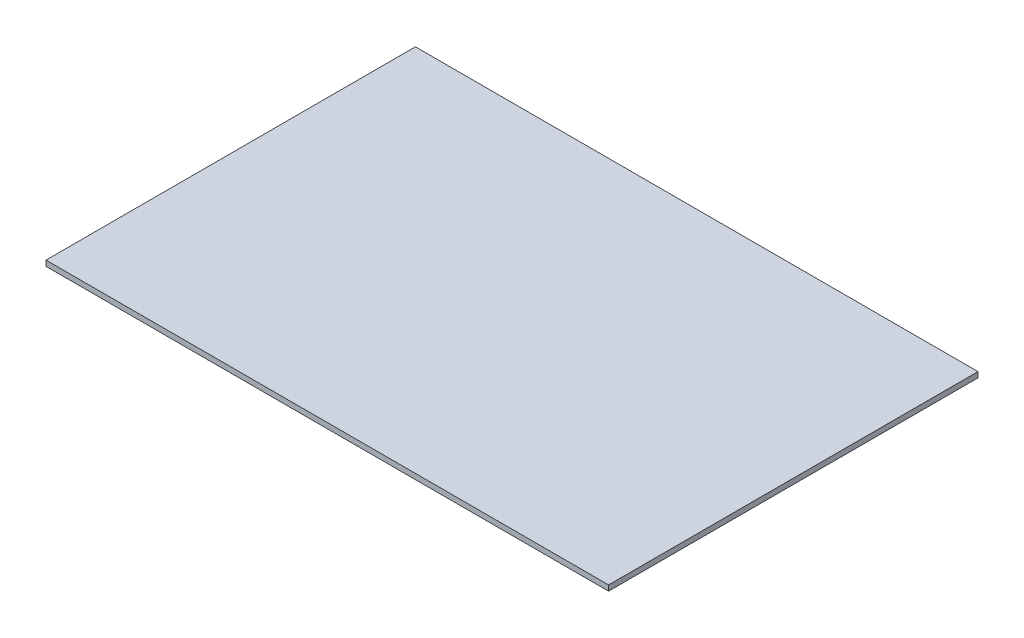
ISO-10303-21;
HEADER;
FILE_DESCRIPTION(('STEP AP214'),'2;1');
FILE_NAME('part.step','',(''),(''),'','','');
FILE_SCHEMA(('AUTOMOTIVE_DESIGN { 1 0 10303 214 1 1 1 1 }'));
ENDSEC;
DATA;
#1=APPLICATION_CONTEXT('core data for automotive mechanical design processes');
#2=APPLICATION_PROTOCOL_DEFINITION('international standard','automotive_design',2000,#1);
#3=PRODUCT_CONTEXT('',#1,'mechanical');
#4=PRODUCT('Part','Part','',(#3));
#5=PRODUCT_RELATED_PRODUCT_CATEGORY('part','',(#4));
#6=PRODUCT_DEFINITION_FORMATION('','',#4);
#7=PRODUCT_DEFINITION_CONTEXT('part definition',#1,'design');
#8=PRODUCT_DEFINITION('design','',#6,#7);
#9=PRODUCT_DEFINITION_SHAPE('','',#8);
#10=(LENGTH_UNIT() NAMED_UNIT(*) SI_UNIT(.MILLI.,.METRE.));
#11=(NAMED_UNIT(*) PLANE_ANGLE_UNIT() SI_UNIT($,.RADIAN.));
#12=(NAMED_UNIT(*) SI_UNIT($,.STERADIAN.) SOLID_ANGLE_UNIT());
#13=UNCERTAINTY_MEASURE_WITH_UNIT(LENGTH_MEASURE(1.E-05),#10,'distance_accuracy_value','');
#14=(GEOMETRIC_REPRESENTATION_CONTEXT(3) GLOBAL_UNCERTAINTY_ASSIGNED_CONTEXT((#13)) GLOBAL_UNIT_ASSIGNED_CONTEXT((#10,
#11,#12)) REPRESENTATION_CONTEXT('',''));
#15=CARTESIAN_POINT('',(0.,0.,0.));
#16=DIRECTION('',(0.,0.,1.));
#17=DIRECTION('',(1.,0.,0.));
#18=AXIS2_PLACEMENT_3D('',#15,#16,#17);
#19=CARTESIAN_POINT('',(150.,2.9,98.5));
#20=DIRECTION('',(-1.,0.,0.));
#21=DIRECTION('',(0.,0.,1.));
#22=AXIS2_PLACEMENT_3D('',#19,#20,#21);
#23=PLANE('',#22);
#24=DIRECTION('',(0.,0.,-1.));
#25=VECTOR('',#24,1.);
#26=CARTESIAN_POINT('',(150.,0.,98.5));
#27=LINE('',#26,#25);
#28=CARTESIAN_POINT('',(150.,0.,98.5));
#29=VERTEX_POINT('',#28);
#30=CARTESIAN_POINT('',(150.,0.,-98.5));
#31=VERTEX_POINT('',#30);
#32=EDGE_CURVE('E97',#29,#31,#27,.T.);
#33=ORIENTED_EDGE('',*,*,#32,.T.);
#34=DIRECTION('',(0.,-1.,0.));
#35=VECTOR('',#34,1.);
#36=CARTESIAN_POINT('',(150.,2.9,-98.5));
#37=LINE('',#36,#35);
#38=CARTESIAN_POINT('',(150.,2.9,-98.5));
#39=VERTEX_POINT('',#38);
#40=EDGE_CURVE('E11',#39,#31,#37,.T.);
#41=ORIENTED_EDGE('',*,*,#40,.F.);
#42=DIRECTION('',(0.,0.,-1.));
#43=VECTOR('',#42,1.);
#44=CARTESIAN_POINT('',(150.,2.9,98.5));
#45=LINE('',#44,#43);
#46=CARTESIAN_POINT('',(150.,2.9,98.5));
#47=VERTEX_POINT('',#46);
#48=EDGE_CURVE('E85',#47,#39,#45,.T.);
#49=ORIENTED_EDGE('',*,*,#48,.F.);
#50=DIRECTION('',(0.,-1.,0.));
#51=VECTOR('',#50,1.);
#52=CARTESIAN_POINT('',(150.,2.9,98.5));
#53=LINE('',#52,#51);
#54=EDGE_CURVE('E93',#47,#29,#53,.T.);
#55=ORIENTED_EDGE('',*,*,#54,.T.);
#56=EDGE_LOOP('',(#33,#41,#49,#55));
#57=FACE_BOUND('',#56,.T.);
#58=ADVANCED_FACE('F34',(#57),#23,.F.);
#59=CARTESIAN_POINT('',(-150.,2.9,-98.5));
#60=DIRECTION('',(0.,0.,1.));
#61=DIRECTION('',(1.,0.,0.));
#62=AXIS2_PLACEMENT_3D('',#59,#60,#61);
#63=PLANE('',#62);
#64=DIRECTION('',(-1.,0.,0.));
#65=VECTOR('',#64,1.);
#66=CARTESIAN_POINT('',(-150.,0.,-98.5));
#67=LINE('',#66,#65);
#68=CARTESIAN_POINT('',(-150.,0.,-98.5));
#69=VERTEX_POINT('',#68);
#70=EDGE_CURVE('E89',#31,#69,#67,.T.);
#71=ORIENTED_EDGE('',*,*,#70,.T.);
#72=DIRECTION('',(0.,-1.,0.));
#73=VECTOR('',#72,1.);
#74=CARTESIAN_POINT('',(-150.,2.9,-98.5));
#75=LINE('',#74,#73);
#76=CARTESIAN_POINT('',(-150.,2.9,-98.5));
#77=VERTEX_POINT('',#76);
#78=EDGE_CURVE('E42',#77,#69,#75,.T.);
#79=ORIENTED_EDGE('',*,*,#78,.F.);
#80=DIRECTION('',(-1.,0.,0.));
#81=VECTOR('',#80,1.);
#82=CARTESIAN_POINT('',(-150.,2.9,-98.5));
#83=LINE('',#82,#81);
#84=EDGE_CURVE('E80',#39,#77,#83,.T.);
#85=ORIENTED_EDGE('',*,*,#84,.F.);
#86=ORIENTED_EDGE('',*,*,#40,.T.);
#87=EDGE_LOOP('',(#71,#79,#85,#86));
#88=FACE_BOUND('',#87,.T.);
#89=ADVANCED_FACE('F88',(#88),#63,.F.);
#90=CARTESIAN_POINT('',(-150.,2.9,98.5));
#91=DIRECTION('',(1.,0.,0.));
#92=DIRECTION('',(0.,0.,-1.));
#93=AXIS2_PLACEMENT_3D('',#90,#91,#92);
#94=PLANE('',#93);
#95=DIRECTION('',(0.,0.,1.));
#96=VECTOR('',#95,1.);
#97=CARTESIAN_POINT('',(-150.,0.,98.5));
#98=LINE('',#97,#96);
#99=CARTESIAN_POINT('',(-150.,0.,98.5));
#100=VERTEX_POINT('',#99);
#101=EDGE_CURVE('E67',#69,#100,#98,.T.);
#102=ORIENTED_EDGE('',*,*,#101,.T.);
#103=DIRECTION('',(0.,-1.,0.));
#104=VECTOR('',#103,1.);
#105=CARTESIAN_POINT('',(-150.,2.9,98.5));
#106=LINE('',#105,#104);
#107=CARTESIAN_POINT('',(-150.,2.9,98.5));
#108=VERTEX_POINT('',#107);
#109=EDGE_CURVE('E90',#108,#100,#106,.T.);
#110=ORIENTED_EDGE('',*,*,#109,.F.);
#111=DIRECTION('',(0.,0.,1.));
#112=VECTOR('',#111,1.);
#113=CARTESIAN_POINT('',(-150.,2.9,98.5));
#114=LINE('',#113,#112);
#115=EDGE_CURVE('E83',#77,#108,#114,.T.);
#116=ORIENTED_EDGE('',*,*,#115,.F.);
#117=ORIENTED_EDGE('',*,*,#78,.T.);
#118=EDGE_LOOP('',(#102,#110,#116,#117));
#119=FACE_BOUND('',#118,.T.);
#120=ADVANCED_FACE('F91',(#119),#94,.F.);
#121=CARTESIAN_POINT('',(-150.,2.9,98.5));
#122=DIRECTION('',(0.,0.,-1.));
#123=DIRECTION('',(-1.,0.,0.));
#124=AXIS2_PLACEMENT_3D('',#121,#122,#123);
#125=PLANE('',#124);
#126=DIRECTION('',(1.,0.,0.));
#127=VECTOR('',#126,1.);
#128=CARTESIAN_POINT('',(-150.,0.,98.5));
#129=LINE('',#128,#127);
#130=EDGE_CURVE('E73',#100,#29,#129,.T.);
#131=ORIENTED_EDGE('',*,*,#130,.T.);
#132=ORIENTED_EDGE('',*,*,#54,.F.);
#133=DIRECTION('',(1.,0.,0.));
#134=VECTOR('',#133,1.);
#135=CARTESIAN_POINT('',(-150.,2.9,98.5));
#136=LINE('',#135,#134);
#137=EDGE_CURVE('E50',#108,#47,#136,.T.);
#138=ORIENTED_EDGE('',*,*,#137,.F.);
#139=ORIENTED_EDGE('',*,*,#109,.T.);
#140=EDGE_LOOP('',(#131,#132,#138,#139));
#141=FACE_BOUND('',#140,.T.);
#142=ADVANCED_FACE('F104',(#141),#125,.F.);
#143=CARTESIAN_POINT('',(0.,2.9,0.));
#144=DIRECTION('',(0.,-1.,0.));
#145=DIRECTION('',(0.,0.,-1.));
#146=AXIS2_PLACEMENT_3D('',#143,#144,#145);
#147=PLANE('',#146);
#148=ORIENTED_EDGE('',*,*,#48,.T.);
#149=ORIENTED_EDGE('',*,*,#84,.T.);
#150=ORIENTED_EDGE('',*,*,#115,.T.);
#151=ORIENTED_EDGE('',*,*,#137,.T.);
#152=EDGE_LOOP('',(#148,#149,#150,#151));
#153=FACE_BOUND('',#152,.T.);
#154=ADVANCED_FACE('F81',(#153),#147,.F.);
#155=CARTESIAN_POINT('',(0.,0.,0.));
#156=DIRECTION('',(0.,-1.,0.));
#157=DIRECTION('',(0.,0.,-1.));
#158=AXIS2_PLACEMENT_3D('',#155,#156,#157);
#159=PLANE('',#158);
#160=ORIENTED_EDGE('',*,*,#32,.F.);
#161=ORIENTED_EDGE('',*,*,#130,.F.);
#162=ORIENTED_EDGE('',*,*,#101,.F.);
#163=ORIENTED_EDGE('',*,*,#70,.F.);
#164=EDGE_LOOP('',(#160,#161,#162,#163));
#165=FACE_BOUND('',#164,.T.);
#166=ADVANCED_FACE('F107',(#165),#159,.T.);
#167=CLOSED_SHELL('',(#58,#89,#120,#142,#154,#166));
#168=MANIFOLD_SOLID_BREP('B2',#167);
#169=ADVANCED_BREP_SHAPE_REPRESENTATION('',(#18,#168),#14);
#170=SHAPE_DEFINITION_REPRESENTATION(#9,#169);
ENDSEC;
END-ISO-10303-21;
